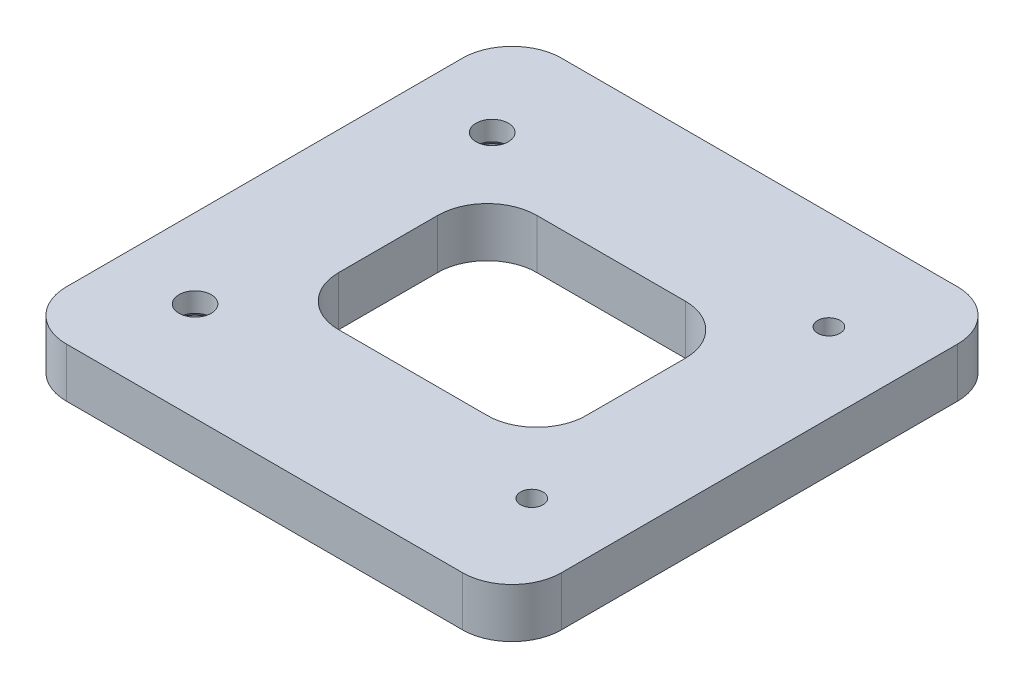
ISO-10303-21;
HEADER;
FILE_DESCRIPTION(('STEP AP214'),'2;1');
FILE_NAME('part.step','',(''),(''),'','','');
FILE_SCHEMA(('AUTOMOTIVE_DESIGN { 1 0 10303 214 1 1 1 1 }'));
ENDSEC;
DATA;
#1=APPLICATION_CONTEXT('core data for automotive mechanical design processes');
#2=APPLICATION_PROTOCOL_DEFINITION('international standard','automotive_design',2000,#1);
#3=PRODUCT_CONTEXT('',#1,'mechanical');
#4=PRODUCT('Part','Part','',(#3));
#5=PRODUCT_RELATED_PRODUCT_CATEGORY('part','',(#4));
#6=PRODUCT_DEFINITION_FORMATION('','',#4);
#7=PRODUCT_DEFINITION_CONTEXT('part definition',#1,'design');
#8=PRODUCT_DEFINITION('design','',#6,#7);
#9=PRODUCT_DEFINITION_SHAPE('','',#8);
#10=(LENGTH_UNIT() NAMED_UNIT(*) SI_UNIT(.MILLI.,.METRE.));
#11=(NAMED_UNIT(*) PLANE_ANGLE_UNIT() SI_UNIT($,.RADIAN.));
#12=(NAMED_UNIT(*) SI_UNIT($,.STERADIAN.) SOLID_ANGLE_UNIT());
#13=UNCERTAINTY_MEASURE_WITH_UNIT(LENGTH_MEASURE(1.E-05),#10,'distance_accuracy_value','');
#14=(GEOMETRIC_REPRESENTATION_CONTEXT(3) GLOBAL_UNCERTAINTY_ASSIGNED_CONTEXT((#13)) GLOBAL_UNIT_ASSIGNED_CONTEXT((#10,
#11,#12)) REPRESENTATION_CONTEXT('',''));
#15=CARTESIAN_POINT('',(0.,0.,0.));
#16=DIRECTION('',(0.,0.,1.));
#17=DIRECTION('',(1.,0.,0.));
#18=AXIS2_PLACEMENT_3D('',#15,#16,#17);
#19=CARTESIAN_POINT('',(0.,-2.5,0.));
#20=DIRECTION('',(0.,1.,0.));
#21=DIRECTION('',(0.,0.,1.));
#22=AXIS2_PLACEMENT_3D('',#19,#20,#21);
#23=PLANE('',#22);
#24=DIRECTION('',(-1.,0.,0.));
#25=VECTOR('',#24,1.);
#26=CARTESIAN_POINT('',(-12.5,-2.5,10.));
#27=LINE('',#26,#25);
#28=CARTESIAN_POINT('',(7.5,-2.5,10.));
#29=VERTEX_POINT('',#28);
#30=CARTESIAN_POINT('',(-7.5,-2.5,10.));
#31=VERTEX_POINT('',#30);
#32=EDGE_CURVE('E165',#29,#31,#27,.T.);
#33=ORIENTED_EDGE('',*,*,#32,.F.);
#34=CARTESIAN_POINT('',(7.5,-2.5,5.));
#35=DIRECTION('',(0.,1.,0.));
#36=DIRECTION('',(0.,0.,1.));
#37=AXIS2_PLACEMENT_3D('',#34,#35,#36);
#38=CIRCLE('',#37,5.);
#39=CARTESIAN_POINT('',(12.5,-2.5,5.));
#40=VERTEX_POINT('',#39);
#41=EDGE_CURVE('E174',#29,#40,#38,.T.);
#42=ORIENTED_EDGE('',*,*,#41,.T.);
#43=DIRECTION('',(0.,0.,1.));
#44=VECTOR('',#43,1.);
#45=CARTESIAN_POINT('',(12.5,-2.5,10.));
#46=LINE('',#45,#44);
#47=CARTESIAN_POINT('',(12.5,-2.5,-5.));
#48=VERTEX_POINT('',#47);
#49=EDGE_CURVE('E177',#48,#40,#46,.T.);
#50=ORIENTED_EDGE('',*,*,#49,.F.);
#51=CARTESIAN_POINT('',(7.5,-2.5,-5.));
#52=DIRECTION('',(0.,1.,0.));
#53=DIRECTION('',(0.,0.,1.));
#54=AXIS2_PLACEMENT_3D('',#51,#52,#53);
#55=CIRCLE('',#54,5.);
#56=CARTESIAN_POINT('',(7.5,-2.5,-10.));
#57=VERTEX_POINT('',#56);
#58=EDGE_CURVE('E188',#48,#57,#55,.T.);
#59=ORIENTED_EDGE('',*,*,#58,.T.);
#60=DIRECTION('',(1.,0.,0.));
#61=VECTOR('',#60,1.);
#62=CARTESIAN_POINT('',(-12.5,-2.5,-10.));
#63=LINE('',#62,#61);
#64=CARTESIAN_POINT('',(-7.5,-2.5,-10.));
#65=VERTEX_POINT('',#64);
#66=EDGE_CURVE('E303',#65,#57,#63,.T.);
#67=ORIENTED_EDGE('',*,*,#66,.F.);
#68=CARTESIAN_POINT('',(-7.5,-2.5,-5.));
#69=DIRECTION('',(0.,1.,0.));
#70=DIRECTION('',(0.,0.,1.));
#71=AXIS2_PLACEMENT_3D('',#68,#69,#70);
#72=CIRCLE('',#71,5.);
#73=CARTESIAN_POINT('',(-12.5,-2.5,-5.));
#74=VERTEX_POINT('',#73);
#75=EDGE_CURVE('E11',#65,#74,#72,.T.);
#76=ORIENTED_EDGE('',*,*,#75,.T.);
#77=DIRECTION('',(0.,0.,-1.));
#78=VECTOR('',#77,1.);
#79=CARTESIAN_POINT('',(-12.5,-2.5,10.));
#80=LINE('',#79,#78);
#81=CARTESIAN_POINT('',(-12.5,-2.5,5.));
#82=VERTEX_POINT('',#81);
#83=EDGE_CURVE('E179',#82,#74,#80,.T.);
#84=ORIENTED_EDGE('',*,*,#83,.F.);
#85=CARTESIAN_POINT('',(-7.5,-2.5,5.));
#86=DIRECTION('',(0.,1.,0.));
#87=DIRECTION('',(0.,0.,1.));
#88=AXIS2_PLACEMENT_3D('',#85,#86,#87);
#89=CIRCLE('',#88,5.);
#90=EDGE_CURVE('E176',#82,#31,#89,.T.);
#91=ORIENTED_EDGE('',*,*,#90,.T.);
#92=EDGE_LOOP('',(#33,#42,#50,#59,#67,#76,#84,#91));
#93=FACE_BOUND('',#92,.T.);
#94=CARTESIAN_POINT('',(17.,-2.5,-15.));
#95=DIRECTION('',(0.,1.,0.));
#96=DIRECTION('',(0.,0.,1.));
#97=AXIS2_PLACEMENT_3D('',#94,#95,#96);
#98=CIRCLE('',#97,1.1303);
#99=CARTESIAN_POINT('',(17.,-2.5,-13.8697));
#100=VERTEX_POINT('',#99);
#101=EDGE_CURVE('E271',#100,#100,#98,.T.);
#102=ORIENTED_EDGE('',*,*,#101,.T.);
#103=EDGE_LOOP('',(#102));
#104=FACE_BOUND('',#103,.T.);
#105=CARTESIAN_POINT('',(17.,-2.5,15.));
#106=DIRECTION('',(0.,1.,0.));
#107=DIRECTION('',(0.,0.,1.));
#108=AXIS2_PLACEMENT_3D('',#105,#106,#107);
#109=CIRCLE('',#108,1.1303);
#110=CARTESIAN_POINT('',(17.,-2.5,16.1303));
#111=VERTEX_POINT('',#110);
#112=EDGE_CURVE('E260',#111,#111,#109,.T.);
#113=ORIENTED_EDGE('',*,*,#112,.T.);
#114=EDGE_LOOP('',(#113));
#115=FACE_BOUND('',#114,.T.);
#116=DIRECTION('',(0.,0.,1.));
#117=VECTOR('',#116,1.);
#118=CARTESIAN_POINT('',(-25.,-2.5,25.));
#119=LINE('',#118,#117);
#120=CARTESIAN_POINT('',(-25.,-2.5,-20.));
#121=VERTEX_POINT('',#120);
#122=CARTESIAN_POINT('',(-25.,-2.5,20.));
#123=VERTEX_POINT('',#122);
#124=EDGE_CURVE('E255',#121,#123,#119,.T.);
#125=ORIENTED_EDGE('',*,*,#124,.F.);
#126=CARTESIAN_POINT('',(-20.,-2.5,-20.));
#127=DIRECTION('',(0.,1.,0.));
#128=DIRECTION('',(0.,0.,1.));
#129=AXIS2_PLACEMENT_3D('',#126,#127,#128);
#130=CIRCLE('',#129,5.);
#131=CARTESIAN_POINT('',(-20.,-2.5,-25.));
#132=VERTEX_POINT('',#131);
#133=EDGE_CURVE('E217',#121,#132,#130,.F.);
#134=ORIENTED_EDGE('',*,*,#133,.T.);
#135=DIRECTION('',(-1.,0.,0.));
#136=VECTOR('',#135,1.);
#137=CARTESIAN_POINT('',(25.,-2.5,-25.));
#138=LINE('',#137,#136);
#139=CARTESIAN_POINT('',(20.,-2.5,-25.));
#140=VERTEX_POINT('',#139);
#141=EDGE_CURVE('E241',#140,#132,#138,.T.);
#142=ORIENTED_EDGE('',*,*,#141,.F.);
#143=CARTESIAN_POINT('',(20.,-2.5,-20.));
#144=DIRECTION('',(0.,1.,0.));
#145=DIRECTION('',(0.,0.,1.));
#146=AXIS2_PLACEMENT_3D('',#143,#144,#145);
#147=CIRCLE('',#146,5.);
#148=CARTESIAN_POINT('',(25.,-2.5,-20.));
#149=VERTEX_POINT('',#148);
#150=EDGE_CURVE('E219',#140,#149,#147,.F.);
#151=ORIENTED_EDGE('',*,*,#150,.T.);
#152=DIRECTION('',(0.,0.,-1.));
#153=VECTOR('',#152,1.);
#154=CARTESIAN_POINT('',(25.,-2.5,25.));
#155=LINE('',#154,#153);
#156=CARTESIAN_POINT('',(25.,-2.5,20.));
#157=VERTEX_POINT('',#156);
#158=EDGE_CURVE('E247',#157,#149,#155,.T.);
#159=ORIENTED_EDGE('',*,*,#158,.F.);
#160=CARTESIAN_POINT('',(20.,-2.5,20.));
#161=DIRECTION('',(0.,1.,0.));
#162=DIRECTION('',(0.,0.,1.));
#163=AXIS2_PLACEMENT_3D('',#160,#161,#162);
#164=CIRCLE('',#163,5.);
#165=CARTESIAN_POINT('',(20.,-2.5,25.));
#166=VERTEX_POINT('',#165);
#167=EDGE_CURVE('E225',#157,#166,#164,.F.);
#168=ORIENTED_EDGE('',*,*,#167,.T.);
#169=DIRECTION('',(1.,0.,0.));
#170=VECTOR('',#169,1.);
#171=CARTESIAN_POINT('',(25.,-2.5,25.));
#172=LINE('',#171,#170);
#173=CARTESIAN_POINT('',(-20.,-2.5,25.));
#174=VERTEX_POINT('',#173);
#175=EDGE_CURVE('E253',#174,#166,#172,.T.);
#176=ORIENTED_EDGE('',*,*,#175,.F.);
#177=CARTESIAN_POINT('',(-20.,-2.5,20.));
#178=DIRECTION('',(0.,1.,0.));
#179=DIRECTION('',(0.,0.,1.));
#180=AXIS2_PLACEMENT_3D('',#177,#178,#179);
#181=CIRCLE('',#180,5.);
#182=EDGE_CURVE('E221',#174,#123,#181,.F.);
#183=ORIENTED_EDGE('',*,*,#182,.T.);
#184=EDGE_LOOP('',(#125,#134,#142,#151,#159,#168,#176,#183));
#185=FACE_BOUND('',#184,.T.);
#186=CARTESIAN_POINT('',(-17.,-2.5,15.));
#187=DIRECTION('',(0.,-1.,0.));
#188=DIRECTION('',(0.,0.,-1.));
#189=AXIS2_PLACEMENT_3D('',#186,#187,#188);
#190=CIRCLE('',#189,2.857490729);
#191=CARTESIAN_POINT('',(-17.,-2.5,12.142509271));
#192=VERTEX_POINT('',#191);
#193=EDGE_CURVE('E288',#192,#192,#190,.T.);
#194=ORIENTED_EDGE('',*,*,#193,.F.);
#195=EDGE_LOOP('',(#194));
#196=FACE_BOUND('',#195,.T.);
#197=CARTESIAN_POINT('',(-17.,-2.5,-15.));
#198=DIRECTION('',(0.,-1.,0.));
#199=DIRECTION('',(0.,0.,-1.));
#200=AXIS2_PLACEMENT_3D('',#197,#198,#199);
#201=CIRCLE('',#200,2.857490729);
#202=CARTESIAN_POINT('',(-17.,-2.5,-17.857490729));
#203=VERTEX_POINT('',#202);
#204=EDGE_CURVE('E298',#203,#203,#201,.T.);
#205=ORIENTED_EDGE('',*,*,#204,.F.);
#206=EDGE_LOOP('',(#205));
#207=FACE_BOUND('',#206,.T.);
#208=ADVANCED_FACE('F43',(#93,#104,#115,#185,#196,#207),#23,.F.);
#209=CARTESIAN_POINT('',(-25.,2.5,25.));
#210=DIRECTION('',(1.,0.,0.));
#211=DIRECTION('',(0.,0.,-1.));
#212=AXIS2_PLACEMENT_3D('',#209,#210,#211);
#213=PLANE('',#212);
#214=DIRECTION('',(0.,0.,1.));
#215=VECTOR('',#214,1.);
#216=CARTESIAN_POINT('',(-25.,2.5,25.));
#217=LINE('',#216,#215);
#218=CARTESIAN_POINT('',(-25.,2.5,-20.));
#219=VERTEX_POINT('',#218);
#220=CARTESIAN_POINT('',(-25.,2.5,20.));
#221=VERTEX_POINT('',#220);
#222=EDGE_CURVE('E246',#219,#221,#217,.T.);
#223=ORIENTED_EDGE('',*,*,#222,.F.);
#224=DIRECTION('',(0.,-1.,0.));
#225=VECTOR('',#224,1.);
#226=CARTESIAN_POINT('',(-25.,2.5,-20.));
#227=LINE('',#226,#225);
#228=EDGE_CURVE('E227',#219,#121,#227,.T.);
#229=ORIENTED_EDGE('',*,*,#228,.T.);
#230=ORIENTED_EDGE('',*,*,#124,.T.);
#231=DIRECTION('',(0.,-1.,0.));
#232=VECTOR('',#231,1.);
#233=CARTESIAN_POINT('',(-25.,2.5,20.));
#234=LINE('',#233,#232);
#235=EDGE_CURVE('E229',#123,#221,#234,.F.);
#236=ORIENTED_EDGE('',*,*,#235,.T.);
#237=EDGE_LOOP('',(#223,#229,#230,#236));
#238=FACE_BOUND('',#237,.T.);
#239=ADVANCED_FACE('F354',(#238),#213,.F.);
#240=CARTESIAN_POINT('',(25.,2.5,25.));
#241=DIRECTION('',(0.,0.,-1.));
#242=DIRECTION('',(-1.,0.,0.));
#243=AXIS2_PLACEMENT_3D('',#240,#241,#242);
#244=PLANE('',#243);
#245=ORIENTED_EDGE('',*,*,#175,.T.);
#246=DIRECTION('',(0.,-1.,0.));
#247=VECTOR('',#246,1.);
#248=CARTESIAN_POINT('',(20.,2.5,25.));
#249=LINE('',#248,#247);
#250=CARTESIAN_POINT('',(20.,2.5,25.));
#251=VERTEX_POINT('',#250);
#252=EDGE_CURVE('E197',#166,#251,#249,.F.);
#253=ORIENTED_EDGE('',*,*,#252,.T.);
#254=DIRECTION('',(1.,0.,0.));
#255=VECTOR('',#254,1.);
#256=CARTESIAN_POINT('',(25.,2.5,25.));
#257=LINE('',#256,#255);
#258=CARTESIAN_POINT('',(-20.,2.5,25.));
#259=VERTEX_POINT('',#258);
#260=EDGE_CURVE('E265',#259,#251,#257,.T.);
#261=ORIENTED_EDGE('',*,*,#260,.F.);
#262=DIRECTION('',(0.,-1.,0.));
#263=VECTOR('',#262,1.);
#264=CARTESIAN_POINT('',(-20.,2.5,25.));
#265=LINE('',#264,#263);
#266=EDGE_CURVE('E200',#259,#174,#265,.T.);
#267=ORIENTED_EDGE('',*,*,#266,.T.);
#268=EDGE_LOOP('',(#245,#253,#261,#267));
#269=FACE_BOUND('',#268,.T.);
#270=ADVANCED_FACE('F357',(#269),#244,.F.);
#271=CARTESIAN_POINT('',(25.,2.5,25.));
#272=DIRECTION('',(-1.,0.,0.));
#273=DIRECTION('',(0.,0.,1.));
#274=AXIS2_PLACEMENT_3D('',#271,#272,#273);
#275=PLANE('',#274);
#276=ORIENTED_EDGE('',*,*,#158,.T.);
#277=DIRECTION('',(0.,-1.,0.));
#278=VECTOR('',#277,1.);
#279=CARTESIAN_POINT('',(25.,2.5,-20.));
#280=LINE('',#279,#278);
#281=CARTESIAN_POINT('',(25.,2.5,-20.));
#282=VERTEX_POINT('',#281);
#283=EDGE_CURVE('E59',#149,#282,#280,.F.);
#284=ORIENTED_EDGE('',*,*,#283,.T.);
#285=DIRECTION('',(0.,0.,-1.));
#286=VECTOR('',#285,1.);
#287=CARTESIAN_POINT('',(25.,2.5,25.));
#288=LINE('',#287,#286);
#289=CARTESIAN_POINT('',(25.,2.5,20.));
#290=VERTEX_POINT('',#289);
#291=EDGE_CURVE('E257',#290,#282,#288,.T.);
#292=ORIENTED_EDGE('',*,*,#291,.F.);
#293=DIRECTION('',(0.,-1.,0.));
#294=VECTOR('',#293,1.);
#295=CARTESIAN_POINT('',(25.,2.5,20.));
#296=LINE('',#295,#294);
#297=EDGE_CURVE('E201',#290,#157,#296,.T.);
#298=ORIENTED_EDGE('',*,*,#297,.T.);
#299=EDGE_LOOP('',(#276,#284,#292,#298));
#300=FACE_BOUND('',#299,.T.);
#301=ADVANCED_FACE('F366',(#300),#275,.F.);
#302=CARTESIAN_POINT('',(25.,2.5,-25.));
#303=DIRECTION('',(0.,0.,1.));
#304=DIRECTION('',(1.,0.,0.));
#305=AXIS2_PLACEMENT_3D('',#302,#303,#304);
#306=PLANE('',#305);
#307=ORIENTED_EDGE('',*,*,#141,.T.);
#308=DIRECTION('',(0.,-1.,0.));
#309=VECTOR('',#308,1.);
#310=CARTESIAN_POINT('',(-20.,2.5,-25.));
#311=LINE('',#310,#309);
#312=CARTESIAN_POINT('',(-20.,2.5,-25.));
#313=VERTEX_POINT('',#312);
#314=EDGE_CURVE('E213',#132,#313,#311,.F.);
#315=ORIENTED_EDGE('',*,*,#314,.T.);
#316=DIRECTION('',(-1.,0.,0.));
#317=VECTOR('',#316,1.);
#318=CARTESIAN_POINT('',(25.,2.5,-25.));
#319=LINE('',#318,#317);
#320=CARTESIAN_POINT('',(20.,2.5,-25.));
#321=VERTEX_POINT('',#320);
#322=EDGE_CURVE('E166',#321,#313,#319,.T.);
#323=ORIENTED_EDGE('',*,*,#322,.F.);
#324=DIRECTION('',(0.,-1.,0.));
#325=VECTOR('',#324,1.);
#326=CARTESIAN_POINT('',(20.,2.5,-25.));
#327=LINE('',#326,#325);
#328=EDGE_CURVE('E214',#321,#140,#327,.T.);
#329=ORIENTED_EDGE('',*,*,#328,.T.);
#330=EDGE_LOOP('',(#307,#315,#323,#329));
#331=FACE_BOUND('',#330,.T.);
#332=ADVANCED_FACE('F364',(#331),#306,.F.);
#333=CARTESIAN_POINT('',(0.,2.5,0.));
#334=DIRECTION('',(0.,1.,0.));
#335=DIRECTION('',(0.,0.,1.));
#336=AXIS2_PLACEMENT_3D('',#333,#334,#335);
#337=PLANE('',#336);
#338=DIRECTION('',(0.,0.,-1.));
#339=VECTOR('',#338,1.);
#340=CARTESIAN_POINT('',(12.5,2.5,10.));
#341=LINE('',#340,#339);
#342=CARTESIAN_POINT('',(12.5,2.5,5.));
#343=VERTEX_POINT('',#342);
#344=CARTESIAN_POINT('',(12.5,2.5,-5.));
#345=VERTEX_POINT('',#344);
#346=EDGE_CURVE('E313',#343,#345,#341,.T.);
#347=ORIENTED_EDGE('',*,*,#346,.F.);
#348=CARTESIAN_POINT('',(7.5,2.5,5.));
#349=DIRECTION('',(0.,1.,0.));
#350=DIRECTION('',(0.,0.,1.));
#351=AXIS2_PLACEMENT_3D('',#348,#349,#350);
#352=CIRCLE('',#351,5.);
#353=CARTESIAN_POINT('',(7.5,2.5,10.));
#354=VERTEX_POINT('',#353);
#355=EDGE_CURVE('E187',#343,#354,#352,.F.);
#356=ORIENTED_EDGE('',*,*,#355,.T.);
#357=DIRECTION('',(1.,0.,0.));
#358=VECTOR('',#357,1.);
#359=CARTESIAN_POINT('',(-12.5,2.5,10.));
#360=LINE('',#359,#358);
#361=CARTESIAN_POINT('',(-7.5,2.5,10.));
#362=VERTEX_POINT('',#361);
#363=EDGE_CURVE('E164',#362,#354,#360,.T.);
#364=ORIENTED_EDGE('',*,*,#363,.F.);
#365=CARTESIAN_POINT('',(-7.5,2.5,5.));
#366=DIRECTION('',(0.,1.,0.));
#367=DIRECTION('',(0.,0.,1.));
#368=AXIS2_PLACEMENT_3D('',#365,#366,#367);
#369=CIRCLE('',#368,5.);
#370=CARTESIAN_POINT('',(-12.5,2.5,5.));
#371=VERTEX_POINT('',#370);
#372=EDGE_CURVE('E194',#362,#371,#369,.F.);
#373=ORIENTED_EDGE('',*,*,#372,.T.);
#374=DIRECTION('',(0.,0.,1.));
#375=VECTOR('',#374,1.);
#376=CARTESIAN_POINT('',(-12.5,2.5,10.));
#377=LINE('',#376,#375);
#378=CARTESIAN_POINT('',(-12.5,2.5,-5.));
#379=VERTEX_POINT('',#378);
#380=EDGE_CURVE('E304',#379,#371,#377,.T.);
#381=ORIENTED_EDGE('',*,*,#380,.F.);
#382=CARTESIAN_POINT('',(-7.5,2.5,-5.));
#383=DIRECTION('',(0.,1.,0.));
#384=DIRECTION('',(0.,0.,1.));
#385=AXIS2_PLACEMENT_3D('',#382,#383,#384);
#386=CIRCLE('',#385,5.);
#387=CARTESIAN_POINT('',(-7.5,2.5,-10.));
#388=VERTEX_POINT('',#387);
#389=EDGE_CURVE('E51',#379,#388,#386,.F.);
#390=ORIENTED_EDGE('',*,*,#389,.T.);
#391=DIRECTION('',(-1.,0.,0.));
#392=VECTOR('',#391,1.);
#393=CARTESIAN_POINT('',(-12.5,2.5,-10.));
#394=LINE('',#393,#392);
#395=CARTESIAN_POINT('',(7.5,2.5,-10.));
#396=VERTEX_POINT('',#395);
#397=EDGE_CURVE('E306',#396,#388,#394,.T.);
#398=ORIENTED_EDGE('',*,*,#397,.F.);
#399=CARTESIAN_POINT('',(7.5,2.5,-5.));
#400=DIRECTION('',(0.,1.,0.));
#401=DIRECTION('',(0.,0.,1.));
#402=AXIS2_PLACEMENT_3D('',#399,#400,#401);
#403=CIRCLE('',#402,5.);
#404=EDGE_CURVE('E195',#396,#345,#403,.F.);
#405=ORIENTED_EDGE('',*,*,#404,.T.);
#406=EDGE_LOOP('',(#347,#356,#364,#373,#381,#390,#398,#405));
#407=FACE_BOUND('',#406,.T.);
#408=CARTESIAN_POINT('',(-17.,2.5,-15.));
#409=DIRECTION('',(0.,1.,0.));
#410=DIRECTION('',(0.,0.,1.));
#411=AXIS2_PLACEMENT_3D('',#408,#409,#410);
#412=CIRCLE('',#411,1.63195);
#413=CARTESIAN_POINT('',(-17.,2.5,-13.36805));
#414=VERTEX_POINT('',#413);
#415=EDGE_CURVE('E287',#414,#414,#412,.T.);
#416=ORIENTED_EDGE('',*,*,#415,.F.);
#417=EDGE_LOOP('',(#416));
#418=FACE_BOUND('',#417,.T.);
#419=CARTESIAN_POINT('',(-17.,2.5,15.));
#420=DIRECTION('',(0.,1.,0.));
#421=DIRECTION('',(0.,0.,1.));
#422=AXIS2_PLACEMENT_3D('',#419,#420,#421);
#423=CIRCLE('',#422,1.63195);
#424=CARTESIAN_POINT('',(-17.,2.5,16.63195));
#425=VERTEX_POINT('',#424);
#426=EDGE_CURVE('E280',#425,#425,#423,.T.);
#427=ORIENTED_EDGE('',*,*,#426,.F.);
#428=EDGE_LOOP('',(#427));
#429=FACE_BOUND('',#428,.T.);
#430=CARTESIAN_POINT('',(17.,2.5,-15.));
#431=DIRECTION('',(0.,1.,0.));
#432=DIRECTION('',(0.,0.,1.));
#433=AXIS2_PLACEMENT_3D('',#430,#431,#432);
#434=CIRCLE('',#433,1.1303);
#435=CARTESIAN_POINT('',(17.,2.5,-13.8697));
#436=VERTEX_POINT('',#435);
#437=EDGE_CURVE('E273',#436,#436,#434,.T.);
#438=ORIENTED_EDGE('',*,*,#437,.F.);
#439=EDGE_LOOP('',(#438));
#440=FACE_BOUND('',#439,.T.);
#441=CARTESIAN_POINT('',(17.,2.5,15.));
#442=DIRECTION('',(0.,1.,0.));
#443=DIRECTION('',(0.,0.,1.));
#444=AXIS2_PLACEMENT_3D('',#441,#442,#443);
#445=CIRCLE('',#444,1.1303);
#446=CARTESIAN_POINT('',(17.,2.5,16.1303));
#447=VERTEX_POINT('',#446);
#448=EDGE_CURVE('E268',#447,#447,#445,.T.);
#449=ORIENTED_EDGE('',*,*,#448,.F.);
#450=EDGE_LOOP('',(#449));
#451=FACE_BOUND('',#450,.T.);
#452=ORIENTED_EDGE('',*,*,#322,.T.);
#453=CARTESIAN_POINT('',(-20.,2.5,-20.));
#454=DIRECTION('',(0.,1.,0.));
#455=DIRECTION('',(0.,0.,1.));
#456=AXIS2_PLACEMENT_3D('',#453,#454,#455);
#457=CIRCLE('',#456,5.);
#458=EDGE_CURVE('E206',#313,#219,#457,.T.);
#459=ORIENTED_EDGE('',*,*,#458,.T.);
#460=ORIENTED_EDGE('',*,*,#222,.T.);
#461=CARTESIAN_POINT('',(-20.,2.5,20.));
#462=DIRECTION('',(0.,1.,0.));
#463=DIRECTION('',(0.,0.,1.));
#464=AXIS2_PLACEMENT_3D('',#461,#462,#463);
#465=CIRCLE('',#464,5.);
#466=EDGE_CURVE('E211',#221,#259,#465,.T.);
#467=ORIENTED_EDGE('',*,*,#466,.T.);
#468=ORIENTED_EDGE('',*,*,#260,.T.);
#469=CARTESIAN_POINT('',(20.,2.5,20.));
#470=DIRECTION('',(0.,1.,0.));
#471=DIRECTION('',(0.,0.,1.));
#472=AXIS2_PLACEMENT_3D('',#469,#470,#471);
#473=CIRCLE('',#472,5.);
#474=EDGE_CURVE('E61',#251,#290,#473,.T.);
#475=ORIENTED_EDGE('',*,*,#474,.T.);
#476=ORIENTED_EDGE('',*,*,#291,.T.);
#477=CARTESIAN_POINT('',(20.,2.5,-20.));
#478=DIRECTION('',(0.,1.,0.));
#479=DIRECTION('',(0.,0.,1.));
#480=AXIS2_PLACEMENT_3D('',#477,#478,#479);
#481=CIRCLE('',#480,5.);
#482=EDGE_CURVE('E208',#282,#321,#481,.T.);
#483=ORIENTED_EDGE('',*,*,#482,.T.);
#484=EDGE_LOOP('',(#452,#459,#460,#467,#468,#475,#476,#483));
#485=FACE_BOUND('',#484,.T.);
#486=ADVANCED_FACE('F327',(#407,#418,#429,#440,#451,#485),#337,.T.);
#487=CARTESIAN_POINT('',(17.,2.5,15.));
#488=DIRECTION('',(0.,1.,0.));
#489=DIRECTION('',(0.,0.,1.));
#490=AXIS2_PLACEMENT_3D('',#487,#488,#489);
#491=CYLINDRICAL_SURFACE('',#490,1.1303);
#492=ORIENTED_EDGE('',*,*,#112,.F.);
#493=EDGE_LOOP('',(#492));
#494=FACE_BOUND('',#493,.T.);
#495=ORIENTED_EDGE('',*,*,#448,.T.);
#496=EDGE_LOOP('',(#495));
#497=FACE_BOUND('',#496,.T.);
#498=ADVANCED_FACE('F416',(#494,#497),#491,.F.);
#499=CARTESIAN_POINT('',(17.,2.5,-15.));
#500=DIRECTION('',(0.,1.,0.));
#501=DIRECTION('',(0.,0.,1.));
#502=AXIS2_PLACEMENT_3D('',#499,#500,#501);
#503=CYLINDRICAL_SURFACE('',#502,1.1303);
#504=ORIENTED_EDGE('',*,*,#101,.F.);
#505=EDGE_LOOP('',(#504));
#506=FACE_BOUND('',#505,.T.);
#507=ORIENTED_EDGE('',*,*,#437,.T.);
#508=EDGE_LOOP('',(#507));
#509=FACE_BOUND('',#508,.T.);
#510=ADVANCED_FACE('F425',(#506,#509),#503,.F.);
#511=CARTESIAN_POINT('',(-17.,-2.5,15.));
#512=DIRECTION('',(0.,-1.,0.));
#513=DIRECTION('',(0.,0.,-1.));
#514=AXIS2_PLACEMENT_3D('',#511,#512,#513);
#515=CYLINDRICAL_SURFACE('',#514,1.63195);
#516=CARTESIAN_POINT('',(-17.,0.528350773696635,15.));
#517=DIRECTION('',(0.,-1.,0.));
#518=DIRECTION('',(0.,0.,-1.));
#519=AXIS2_PLACEMENT_3D('',#516,#517,#518);
#520=CIRCLE('',#519,1.63195);
#521=CARTESIAN_POINT('',(-17.,0.528350773696635,13.36805));
#522=VERTEX_POINT('',#521);
#523=EDGE_CURVE('E278',#522,#522,#520,.T.);
#524=ORIENTED_EDGE('',*,*,#523,.T.);
#525=EDGE_LOOP('',(#524));
#526=FACE_BOUND('',#525,.T.);
#527=ORIENTED_EDGE('',*,*,#426,.T.);
#528=EDGE_LOOP('',(#527));
#529=FACE_BOUND('',#528,.T.);
#530=ADVANCED_FACE('F430',(#526,#529),#515,.F.);
#531=CARTESIAN_POINT('',(-17.,-0.5,15.));
#532=DIRECTION('',(0.,-1.,0.));
#533=DIRECTION('',(0.,0.,-1.));
#534=AXIS2_PLACEMENT_3D('',#531,#532,#533);
#535=CONICAL_SURFACE('',#534,2.857490729,0.872664625997164);
#536=ORIENTED_EDGE('',*,*,#523,.F.);
#537=EDGE_LOOP('',(#536));
#538=FACE_BOUND('',#537,.T.);
#539=CARTESIAN_POINT('',(-17.,-0.5,15.));
#540=DIRECTION('',(0.,-1.,0.));
#541=DIRECTION('',(0.,0.,-1.));
#542=AXIS2_PLACEMENT_3D('',#539,#540,#541);
#543=CIRCLE('',#542,2.857490729);
#544=CARTESIAN_POINT('',(-17.,-0.5,12.142509271));
#545=VERTEX_POINT('',#544);
#546=EDGE_CURVE('E283',#545,#545,#543,.T.);
#547=ORIENTED_EDGE('',*,*,#546,.T.);
#548=EDGE_LOOP('',(#547));
#549=FACE_BOUND('',#548,.T.);
#550=ADVANCED_FACE('F434',(#538,#549),#535,.F.);
#551=CARTESIAN_POINT('',(-17.,-2.5,15.));
#552=DIRECTION('',(0.,-1.,0.));
#553=DIRECTION('',(0.,0.,-1.));
#554=AXIS2_PLACEMENT_3D('',#551,#552,#553);
#555=CYLINDRICAL_SURFACE('',#554,2.857490729);
#556=ORIENTED_EDGE('',*,*,#546,.F.);
#557=EDGE_LOOP('',(#556));
#558=FACE_BOUND('',#557,.T.);
#559=ORIENTED_EDGE('',*,*,#193,.T.);
#560=EDGE_LOOP('',(#559));
#561=FACE_BOUND('',#560,.T.);
#562=ADVANCED_FACE('F438',(#558,#561),#555,.F.);
#563=CARTESIAN_POINT('',(-17.,-2.5,-15.));
#564=DIRECTION('',(0.,-1.,0.));
#565=DIRECTION('',(0.,0.,-1.));
#566=AXIS2_PLACEMENT_3D('',#563,#564,#565);
#567=CYLINDRICAL_SURFACE('',#566,1.63195);
#568=CARTESIAN_POINT('',(-17.,0.528350773696635,-15.));
#569=DIRECTION('',(0.,-1.,0.));
#570=DIRECTION('',(0.,0.,-1.));
#571=AXIS2_PLACEMENT_3D('',#568,#569,#570);
#572=CIRCLE('',#571,1.63195);
#573=CARTESIAN_POINT('',(-17.,0.528350773696635,-16.63195));
#574=VERTEX_POINT('',#573);
#575=EDGE_CURVE('E295',#574,#574,#572,.T.);
#576=ORIENTED_EDGE('',*,*,#575,.T.);
#577=EDGE_LOOP('',(#576));
#578=FACE_BOUND('',#577,.T.);
#579=ORIENTED_EDGE('',*,*,#415,.T.);
#580=EDGE_LOOP('',(#579));
#581=FACE_BOUND('',#580,.T.);
#582=ADVANCED_FACE('F444',(#578,#581),#567,.F.);
#583=CARTESIAN_POINT('',(-17.,-0.5,-15.));
#584=DIRECTION('',(0.,-1.,0.));
#585=DIRECTION('',(0.,0.,-1.));
#586=AXIS2_PLACEMENT_3D('',#583,#584,#585);
#587=CONICAL_SURFACE('',#586,2.857490729,0.872664625997164);
#588=ORIENTED_EDGE('',*,*,#575,.F.);
#589=EDGE_LOOP('',(#588));
#590=FACE_BOUND('',#589,.T.);
#591=CARTESIAN_POINT('',(-17.,-0.5,-15.));
#592=DIRECTION('',(0.,-1.,0.));
#593=DIRECTION('',(0.,0.,-1.));
#594=AXIS2_PLACEMENT_3D('',#591,#592,#593);
#595=CIRCLE('',#594,2.857490729);
#596=CARTESIAN_POINT('',(-17.,-0.5,-17.857490729));
#597=VERTEX_POINT('',#596);
#598=EDGE_CURVE('E293',#597,#597,#595,.T.);
#599=ORIENTED_EDGE('',*,*,#598,.T.);
#600=EDGE_LOOP('',(#599));
#601=FACE_BOUND('',#600,.T.);
#602=ADVANCED_FACE('F349',(#590,#601),#587,.F.);
#603=CARTESIAN_POINT('',(-17.,-2.5,-15.));
#604=DIRECTION('',(0.,-1.,0.));
#605=DIRECTION('',(0.,0.,-1.));
#606=AXIS2_PLACEMENT_3D('',#603,#604,#605);
#607=CYLINDRICAL_SURFACE('',#606,2.857490729);
#608=ORIENTED_EDGE('',*,*,#598,.F.);
#609=EDGE_LOOP('',(#608));
#610=FACE_BOUND('',#609,.T.);
#611=ORIENTED_EDGE('',*,*,#204,.T.);
#612=EDGE_LOOP('',(#611));
#613=FACE_BOUND('',#612,.T.);
#614=ADVANCED_FACE('F343',(#610,#613),#607,.F.);
#615=CARTESIAN_POINT('',(12.5,-2.501,10.));
#616=DIRECTION('',(1.,0.,0.));
#617=DIRECTION('',(0.,0.,-1.));
#618=AXIS2_PLACEMENT_3D('',#615,#616,#617);
#619=PLANE('',#618);
#620=ORIENTED_EDGE('',*,*,#346,.T.);
#621=DIRECTION('',(0.,1.,0.));
#622=VECTOR('',#621,1.);
#623=CARTESIAN_POINT('',(12.5,-2.5,-5.));
#624=LINE('',#623,#622);
#625=EDGE_CURVE('E233',#345,#48,#624,.F.);
#626=ORIENTED_EDGE('',*,*,#625,.T.);
#627=ORIENTED_EDGE('',*,*,#49,.T.);
#628=DIRECTION('',(0.,1.,0.));
#629=VECTOR('',#628,1.);
#630=CARTESIAN_POINT('',(12.5,2.5,5.));
#631=LINE('',#630,#629);
#632=EDGE_CURVE('E183',#40,#343,#631,.T.);
#633=ORIENTED_EDGE('',*,*,#632,.T.);
#634=EDGE_LOOP('',(#620,#626,#627,#633));
#635=FACE_BOUND('',#634,.T.);
#636=ADVANCED_FACE('F339',(#635),#619,.F.);
#637=CARTESIAN_POINT('',(-12.5,-2.501,10.));
#638=DIRECTION('',(0.,0.,1.));
#639=DIRECTION('',(1.,0.,0.));
#640=AXIS2_PLACEMENT_3D('',#637,#638,#639);
#641=PLANE('',#640);
#642=ORIENTED_EDGE('',*,*,#32,.T.);
#643=DIRECTION('',(0.,1.,0.));
#644=VECTOR('',#643,1.);
#645=CARTESIAN_POINT('',(-7.5,2.5,10.));
#646=LINE('',#645,#644);
#647=EDGE_CURVE('E169',#31,#362,#646,.T.);
#648=ORIENTED_EDGE('',*,*,#647,.T.);
#649=ORIENTED_EDGE('',*,*,#363,.T.);
#650=DIRECTION('',(0.,1.,0.));
#651=VECTOR('',#650,1.);
#652=CARTESIAN_POINT('',(7.5,-2.5,10.));
#653=LINE('',#652,#651);
#654=EDGE_CURVE('E158',#354,#29,#653,.F.);
#655=ORIENTED_EDGE('',*,*,#654,.T.);
#656=EDGE_LOOP('',(#642,#648,#649,#655));
#657=FACE_BOUND('',#656,.T.);
#658=ADVANCED_FACE('F159',(#657),#641,.F.);
#659=CARTESIAN_POINT('',(-12.5,-2.501,10.));
#660=DIRECTION('',(-1.,0.,0.));
#661=DIRECTION('',(0.,0.,1.));
#662=AXIS2_PLACEMENT_3D('',#659,#660,#661);
#663=PLANE('',#662);
#664=ORIENTED_EDGE('',*,*,#380,.T.);
#665=DIRECTION('',(0.,1.,0.));
#666=VECTOR('',#665,1.);
#667=CARTESIAN_POINT('',(-12.5,-2.5,5.));
#668=LINE('',#667,#666);
#669=EDGE_CURVE('E239',#371,#82,#668,.F.);
#670=ORIENTED_EDGE('',*,*,#669,.T.);
#671=ORIENTED_EDGE('',*,*,#83,.T.);
#672=DIRECTION('',(0.,1.,0.));
#673=VECTOR('',#672,1.);
#674=CARTESIAN_POINT('',(-12.5,2.5,-5.));
#675=LINE('',#674,#673);
#676=EDGE_CURVE('E242',#74,#379,#675,.T.);
#677=ORIENTED_EDGE('',*,*,#676,.T.);
#678=EDGE_LOOP('',(#664,#670,#671,#677));
#679=FACE_BOUND('',#678,.T.);
#680=ADVANCED_FACE('F318',(#679),#663,.F.);
#681=CARTESIAN_POINT('',(-12.5,-2.501,-10.));
#682=DIRECTION('',(0.,0.,-1.));
#683=DIRECTION('',(-1.,0.,0.));
#684=AXIS2_PLACEMENT_3D('',#681,#682,#683);
#685=PLANE('',#684);
#686=ORIENTED_EDGE('',*,*,#66,.T.);
#687=DIRECTION('',(0.,1.,0.));
#688=VECTOR('',#687,1.);
#689=CARTESIAN_POINT('',(7.5,2.5,-10.));
#690=LINE('',#689,#688);
#691=EDGE_CURVE('E232',#57,#396,#690,.T.);
#692=ORIENTED_EDGE('',*,*,#691,.T.);
#693=ORIENTED_EDGE('',*,*,#397,.T.);
#694=DIRECTION('',(0.,1.,0.));
#695=VECTOR('',#694,1.);
#696=CARTESIAN_POINT('',(-7.5,-2.5,-10.));
#697=LINE('',#696,#695);
#698=EDGE_CURVE('E240',#388,#65,#697,.F.);
#699=ORIENTED_EDGE('',*,*,#698,.T.);
#700=EDGE_LOOP('',(#686,#692,#693,#699));
#701=FACE_BOUND('',#700,.T.);
#702=ADVANCED_FACE('F332',(#701),#685,.F.);
#703=CARTESIAN_POINT('',(-7.5,-2.501,5.));
#704=DIRECTION('',(0.,-1.,0.));
#705=DIRECTION('',(0.,0.,-1.));
#706=AXIS2_PLACEMENT_3D('',#703,#704,#705);
#707=CYLINDRICAL_SURFACE('',#706,5.);
#708=ORIENTED_EDGE('',*,*,#90,.F.);
#709=ORIENTED_EDGE('',*,*,#669,.F.);
#710=ORIENTED_EDGE('',*,*,#372,.F.);
#711=ORIENTED_EDGE('',*,*,#647,.F.);
#712=EDGE_LOOP('',(#708,#709,#710,#711));
#713=FACE_BOUND('',#712,.T.);
#714=ADVANCED_FACE('F374',(#713),#707,.F.);
#715=CARTESIAN_POINT('',(7.5,-2.501,-5.));
#716=DIRECTION('',(0.,-1.,0.));
#717=DIRECTION('',(0.,0.,-1.));
#718=AXIS2_PLACEMENT_3D('',#715,#716,#717);
#719=CYLINDRICAL_SURFACE('',#718,5.);
#720=ORIENTED_EDGE('',*,*,#58,.F.);
#721=ORIENTED_EDGE('',*,*,#625,.F.);
#722=ORIENTED_EDGE('',*,*,#404,.F.);
#723=ORIENTED_EDGE('',*,*,#691,.F.);
#724=EDGE_LOOP('',(#720,#721,#722,#723));
#725=FACE_BOUND('',#724,.T.);
#726=ADVANCED_FACE('F337',(#725),#719,.F.);
#727=CARTESIAN_POINT('',(7.5,-2.501,5.));
#728=DIRECTION('',(0.,-1.,0.));
#729=DIRECTION('',(0.,0.,-1.));
#730=AXIS2_PLACEMENT_3D('',#727,#728,#729);
#731=CYLINDRICAL_SURFACE('',#730,5.);
#732=ORIENTED_EDGE('',*,*,#41,.F.);
#733=ORIENTED_EDGE('',*,*,#654,.F.);
#734=ORIENTED_EDGE('',*,*,#355,.F.);
#735=ORIENTED_EDGE('',*,*,#632,.F.);
#736=EDGE_LOOP('',(#732,#733,#734,#735));
#737=FACE_BOUND('',#736,.T.);
#738=ADVANCED_FACE('F181',(#737),#731,.F.);
#739=CARTESIAN_POINT('',(-7.5,-2.501,-5.));
#740=DIRECTION('',(0.,-1.,0.));
#741=DIRECTION('',(0.,0.,-1.));
#742=AXIS2_PLACEMENT_3D('',#739,#740,#741);
#743=CYLINDRICAL_SURFACE('',#742,5.);
#744=ORIENTED_EDGE('',*,*,#75,.F.);
#745=ORIENTED_EDGE('',*,*,#698,.F.);
#746=ORIENTED_EDGE('',*,*,#389,.F.);
#747=ORIENTED_EDGE('',*,*,#676,.F.);
#748=EDGE_LOOP('',(#744,#745,#746,#747));
#749=FACE_BOUND('',#748,.T.);
#750=ADVANCED_FACE('F323',(#749),#743,.F.);
#751=CARTESIAN_POINT('',(-20.,2.5,-20.));
#752=DIRECTION('',(0.,-1.,0.));
#753=DIRECTION('',(0.,0.,-1.));
#754=AXIS2_PLACEMENT_3D('',#751,#752,#753);
#755=CYLINDRICAL_SURFACE('',#754,5.);
#756=ORIENTED_EDGE('',*,*,#458,.F.);
#757=ORIENTED_EDGE('',*,*,#314,.F.);
#758=ORIENTED_EDGE('',*,*,#133,.F.);
#759=ORIENTED_EDGE('',*,*,#228,.F.);
#760=EDGE_LOOP('',(#756,#757,#758,#759));
#761=FACE_BOUND('',#760,.T.);
#762=ADVANCED_FACE('F384',(#761),#755,.T.);
#763=CARTESIAN_POINT('',(20.,2.5,-20.));
#764=DIRECTION('',(0.,-1.,0.));
#765=DIRECTION('',(0.,0.,-1.));
#766=AXIS2_PLACEMENT_3D('',#763,#764,#765);
#767=CYLINDRICAL_SURFACE('',#766,5.);
#768=ORIENTED_EDGE('',*,*,#482,.F.);
#769=ORIENTED_EDGE('',*,*,#283,.F.);
#770=ORIENTED_EDGE('',*,*,#150,.F.);
#771=ORIENTED_EDGE('',*,*,#328,.F.);
#772=EDGE_LOOP('',(#768,#769,#770,#771));
#773=FACE_BOUND('',#772,.T.);
#774=ADVANCED_FACE('F389',(#773),#767,.T.);
#775=CARTESIAN_POINT('',(20.,2.5,20.));
#776=DIRECTION('',(0.,-1.,0.));
#777=DIRECTION('',(0.,0.,-1.));
#778=AXIS2_PLACEMENT_3D('',#775,#776,#777);
#779=CYLINDRICAL_SURFACE('',#778,5.);
#780=ORIENTED_EDGE('',*,*,#474,.F.);
#781=ORIENTED_EDGE('',*,*,#252,.F.);
#782=ORIENTED_EDGE('',*,*,#167,.F.);
#783=ORIENTED_EDGE('',*,*,#297,.F.);
#784=EDGE_LOOP('',(#780,#781,#782,#783));
#785=FACE_BOUND('',#784,.T.);
#786=ADVANCED_FACE('F392',(#785),#779,.T.);
#787=CARTESIAN_POINT('',(-20.,2.5,20.));
#788=DIRECTION('',(0.,-1.,0.));
#789=DIRECTION('',(0.,0.,-1.));
#790=AXIS2_PLACEMENT_3D('',#787,#788,#789);
#791=CYLINDRICAL_SURFACE('',#790,5.);
#792=ORIENTED_EDGE('',*,*,#466,.F.);
#793=ORIENTED_EDGE('',*,*,#235,.F.);
#794=ORIENTED_EDGE('',*,*,#182,.F.);
#795=ORIENTED_EDGE('',*,*,#266,.F.);
#796=EDGE_LOOP('',(#792,#793,#794,#795));
#797=FACE_BOUND('',#796,.T.);
#798=ADVANCED_FACE('F44',(#797),#791,.T.);
#799=CLOSED_SHELL('',(#208,#239,#270,#301,#332,#486,#498,#510,#530,#550,#562,#582,#602,#614,
#636,#658,#680,#702,#714,#726,#738,#750,#762,#774,#786,#798));
#800=MANIFOLD_SOLID_BREP('B2',#799);
#801=ADVANCED_BREP_SHAPE_REPRESENTATION('',(#18,#800),#14);
#802=SHAPE_DEFINITION_REPRESENTATION(#9,#801);
ENDSEC;
END-ISO-10303-21;
